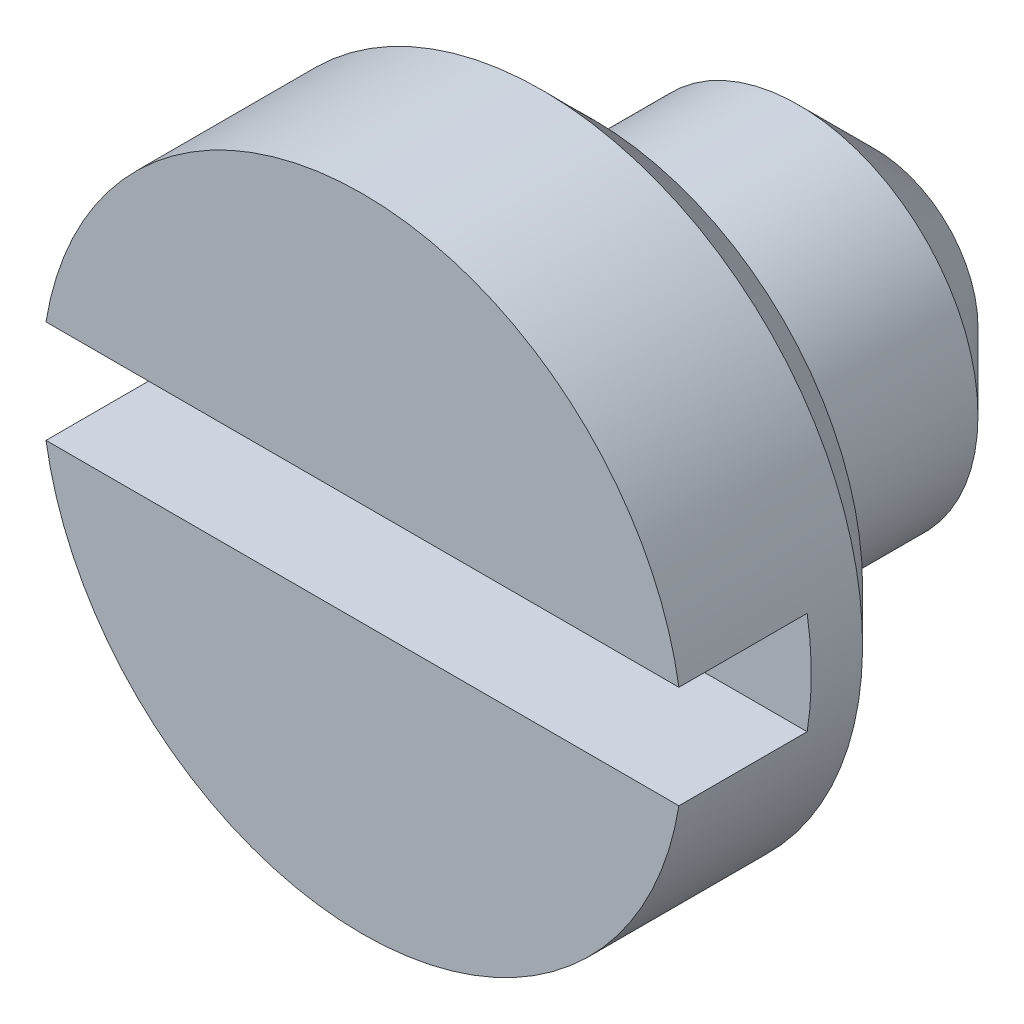
ISO-10303-21;
HEADER;
FILE_DESCRIPTION(('STEP AP214'),'2;1');
FILE_NAME('part.step','',(''),(''),'','','');
FILE_SCHEMA(('AUTOMOTIVE_DESIGN { 1 0 10303 214 1 1 1 1 }'));
ENDSEC;
DATA;
#1=APPLICATION_CONTEXT('core data for automotive mechanical design processes');
#2=APPLICATION_PROTOCOL_DEFINITION('international standard','automotive_design',2000,#1);
#3=PRODUCT_CONTEXT('',#1,'mechanical');
#4=PRODUCT('Part','Part','',(#3));
#5=PRODUCT_RELATED_PRODUCT_CATEGORY('part','',(#4));
#6=PRODUCT_DEFINITION_FORMATION('','',#4);
#7=PRODUCT_DEFINITION_CONTEXT('part definition',#1,'design');
#8=PRODUCT_DEFINITION('design','',#6,#7);
#9=PRODUCT_DEFINITION_SHAPE('','',#8);
#10=(LENGTH_UNIT() NAMED_UNIT(*) SI_UNIT(.MILLI.,.METRE.));
#11=(NAMED_UNIT(*) PLANE_ANGLE_UNIT() SI_UNIT($,.RADIAN.));
#12=(NAMED_UNIT(*) SI_UNIT($,.STERADIAN.) SOLID_ANGLE_UNIT());
#13=UNCERTAINTY_MEASURE_WITH_UNIT(LENGTH_MEASURE(1.E-05),#10,'distance_accuracy_value','');
#14=(GEOMETRIC_REPRESENTATION_CONTEXT(3) GLOBAL_UNCERTAINTY_ASSIGNED_CONTEXT((#13)) GLOBAL_UNIT_ASSIGNED_CONTEXT((#10,
#11,#12)) REPRESENTATION_CONTEXT('',''));
#15=CARTESIAN_POINT('',(0.,0.,0.));
#16=DIRECTION('',(0.,0.,1.));
#17=DIRECTION('',(1.,0.,0.));
#18=AXIS2_PLACEMENT_3D('',#15,#16,#17);
#19=CARTESIAN_POINT('',(0.,0.,0.));
#20=DIRECTION('',(0.,0.,1.));
#21=DIRECTION('',(1.,0.,0.));
#22=AXIS2_PLACEMENT_3D('',#19,#20,#21);
#23=PLANE('',#22);
#24=DIRECTION('',(1.,0.,0.));
#25=VECTOR('',#24,1.);
#26=CARTESIAN_POINT('',(0.,-0.2,0.));
#27=LINE('',#26,#25);
#28=CARTESIAN_POINT('',(-1.23389626792531,-0.2,0.));
#29=VERTEX_POINT('',#28);
#30=CARTESIAN_POINT('',(1.23389626792531,-0.2,0.));
#31=VERTEX_POINT('',#30);
#32=EDGE_CURVE('E85',#29,#31,#27,.T.);
#33=ORIENTED_EDGE('',*,*,#32,.F.);
#34=CARTESIAN_POINT('',(0.,0.,0.));
#35=DIRECTION('',(0.,0.,1.));
#36=DIRECTION('',(1.,0.,0.));
#37=AXIS2_PLACEMENT_3D('',#34,#35,#36);
#38=CIRCLE('',#37,1.25);
#39=EDGE_CURVE('E96',#29,#31,#38,.T.);
#40=ORIENTED_EDGE('',*,*,#39,.T.);
#41=EDGE_LOOP('',(#33,#40));
#42=FACE_BOUND('',#41,.T.);
#43=ADVANCED_FACE('F37',(#42),#23,.T.);
#44=CARTESIAN_POINT('',(0.,0.,-2.));
#45=DIRECTION('',(0.,0.,1.));
#46=DIRECTION('',(1.,0.,0.));
#47=AXIS2_PLACEMENT_3D('',#44,#45,#46);
#48=CYLINDRICAL_SURFACE('',#47,1.25);
#49=CARTESIAN_POINT('',(0.,0.,-0.700000000000001));
#50=DIRECTION('',(0.,0.,-1.));
#51=DIRECTION('',(-1.,0.,0.));
#52=AXIS2_PLACEMENT_3D('',#49,#50,#51);
#53=CIRCLE('',#52,1.25);
#54=CARTESIAN_POINT('',(-1.25,0.,-0.700000000000001));
#55=VERTEX_POINT('',#54);
#56=EDGE_CURVE('E106',#55,#55,#53,.F.);
#57=ORIENTED_EDGE('',*,*,#56,.T.);
#58=EDGE_LOOP('',(#57));
#59=FACE_BOUND('',#58,.T.);
#60=DIRECTION('',(0.,0.,1.));
#61=VECTOR('',#60,1.);
#62=CARTESIAN_POINT('',(1.23389626792531,-0.2,-2.));
#63=LINE('',#62,#61);
#64=CARTESIAN_POINT('',(1.23389626792531,-0.2,-0.5));
#65=VERTEX_POINT('',#64);
#66=EDGE_CURVE('E60',#31,#65,#63,.F.);
#67=ORIENTED_EDGE('',*,*,#66,.F.);
#68=ORIENTED_EDGE('',*,*,#39,.F.);
#69=DIRECTION('',(0.,0.,1.));
#70=VECTOR('',#69,1.);
#71=CARTESIAN_POINT('',(-1.23389626792531,-0.2,-2.));
#72=LINE('',#71,#70);
#73=CARTESIAN_POINT('',(-1.23389626792531,-0.2,-0.5));
#74=VERTEX_POINT('',#73);
#75=EDGE_CURVE('E93',#74,#29,#72,.T.);
#76=ORIENTED_EDGE('',*,*,#75,.F.);
#77=CARTESIAN_POINT('',(0.,0.,-0.5));
#78=DIRECTION('',(0.,0.,-1.));
#79=DIRECTION('',(-1.,0.,0.));
#80=AXIS2_PLACEMENT_3D('',#77,#78,#79);
#81=CIRCLE('',#80,1.25);
#82=CARTESIAN_POINT('',(-1.23389626792531,0.2,-0.5));
#83=VERTEX_POINT('',#82);
#84=EDGE_CURVE('E92',#83,#74,#81,.F.);
#85=ORIENTED_EDGE('',*,*,#84,.F.);
#86=DIRECTION('',(0.,0.,1.));
#87=VECTOR('',#86,1.);
#88=CARTESIAN_POINT('',(-1.23389626792531,0.2,-2.));
#89=LINE('',#88,#87);
#90=CARTESIAN_POINT('',(-1.23389626792531,0.2,0.));
#91=VERTEX_POINT('',#90);
#92=EDGE_CURVE('E80',#91,#83,#89,.F.);
#93=ORIENTED_EDGE('',*,*,#92,.F.);
#94=CARTESIAN_POINT('',(1.23389626792531,0.2,0.));
#95=VERTEX_POINT('',#94);
#96=EDGE_CURVE('E86',#95,#91,#38,.T.);
#97=ORIENTED_EDGE('',*,*,#96,.F.);
#98=DIRECTION('',(0.,0.,1.));
#99=VECTOR('',#98,1.);
#100=CARTESIAN_POINT('',(1.23389626792531,0.2,-2.));
#101=LINE('',#100,#99);
#102=CARTESIAN_POINT('',(1.23389626792531,0.2,-0.5));
#103=VERTEX_POINT('',#102);
#104=EDGE_CURVE('E52',#103,#95,#101,.T.);
#105=ORIENTED_EDGE('',*,*,#104,.F.);
#106=EDGE_CURVE('E105',#65,#103,#81,.F.);
#107=ORIENTED_EDGE('',*,*,#106,.F.);
#108=EDGE_LOOP('',(#67,#68,#76,#85,#93,#97,#105,#107));
#109=FACE_BOUND('',#108,.T.);
#110=ADVANCED_FACE('F90',(#59,#109),#48,.T.);
#111=DIRECTION('',(-1.,0.,0.));
#112=VECTOR('',#111,1.);
#113=CARTESIAN_POINT('',(0.,0.2,0.));
#114=LINE('',#113,#112);
#115=EDGE_CURVE('E77',#95,#91,#114,.T.);
#116=ORIENTED_EDGE('',*,*,#115,.F.);
#117=ORIENTED_EDGE('',*,*,#96,.T.);
#118=EDGE_LOOP('',(#116,#117));
#119=FACE_BOUND('',#118,.T.);
#120=ADVANCED_FACE('F95',(#119),#23,.T.);
#121=CARTESIAN_POINT('',(0.,0.,-0.9));
#122=DIRECTION('',(0.,0.,-1.));
#123=DIRECTION('',(-1.,0.,0.));
#124=AXIS2_PLACEMENT_3D('',#121,#122,#123);
#125=PLANE('',#124);
#126=CARTESIAN_POINT('',(0.,0.,-0.9));
#127=DIRECTION('',(0.,0.,-1.));
#128=DIRECTION('',(-1.,0.,0.));
#129=AXIS2_PLACEMENT_3D('',#126,#127,#128);
#130=CIRCLE('',#129,1.05);
#131=CARTESIAN_POINT('',(-1.05,0.,-0.9));
#132=VERTEX_POINT('',#131);
#133=EDGE_CURVE('E109',#132,#132,#130,.T.);
#134=ORIENTED_EDGE('',*,*,#133,.T.);
#135=EDGE_LOOP('',(#134));
#136=FACE_BOUND('',#135,.T.);
#137=CARTESIAN_POINT('',(0.,0.,-0.9));
#138=DIRECTION('',(0.,0.,-1.));
#139=DIRECTION('',(-1.,0.,0.));
#140=AXIS2_PLACEMENT_3D('',#137,#138,#139);
#141=CIRCLE('',#140,0.7);
#142=CARTESIAN_POINT('',(-0.7,0.,-0.9));
#143=VERTEX_POINT('',#142);
#144=EDGE_CURVE('E99',#143,#143,#141,.T.);
#145=ORIENTED_EDGE('',*,*,#144,.F.);
#146=EDGE_LOOP('',(#145));
#147=FACE_BOUND('',#146,.T.);
#148=ADVANCED_FACE('F136',(#136,#147),#125,.T.);
#149=CARTESIAN_POINT('',(0.,0.,-0.9));
#150=DIRECTION('',(0.,0.,-1.));
#151=DIRECTION('',(-1.,0.,0.));
#152=AXIS2_PLACEMENT_3D('',#149,#150,#151);
#153=CYLINDRICAL_SURFACE('',#152,0.7);
#154=CARTESIAN_POINT('',(0.,0.,-1.7));
#155=DIRECTION('',(0.,0.,1.));
#156=DIRECTION('',(1.,0.,0.));
#157=AXIS2_PLACEMENT_3D('',#154,#155,#156);
#158=CIRCLE('',#157,0.7);
#159=CARTESIAN_POINT('',(0.7,0.,-1.7));
#160=VERTEX_POINT('',#159);
#161=EDGE_CURVE('E12',#160,#160,#158,.T.);
#162=ORIENTED_EDGE('',*,*,#161,.T.);
#163=EDGE_LOOP('',(#162));
#164=FACE_BOUND('',#163,.T.);
#165=ORIENTED_EDGE('',*,*,#144,.T.);
#166=EDGE_LOOP('',(#165));
#167=FACE_BOUND('',#166,.T.);
#168=ADVANCED_FACE('F140',(#164,#167),#153,.T.);
#169=CARTESIAN_POINT('',(0.,0.,-2.));
#170=DIRECTION('',(0.,0.,1.));
#171=DIRECTION('',(1.,0.,0.));
#172=AXIS2_PLACEMENT_3D('',#169,#170,#171);
#173=PLANE('',#172);
#174=CARTESIAN_POINT('',(0.,0.,-2.));
#175=DIRECTION('',(0.,0.,1.));
#176=DIRECTION('',(1.,0.,0.));
#177=AXIS2_PLACEMENT_3D('',#174,#175,#176);
#178=CIRCLE('',#177,0.4);
#179=CARTESIAN_POINT('',(0.4,0.,-2.));
#180=VERTEX_POINT('',#179);
#181=EDGE_CURVE('E45',#180,#180,#178,.F.);
#182=ORIENTED_EDGE('',*,*,#181,.T.);
#183=EDGE_LOOP('',(#182));
#184=FACE_BOUND('',#183,.T.);
#185=ADVANCED_FACE('F114',(#184),#173,.F.);
#186=CARTESIAN_POINT('',(-1.35,-0.2,-0.5));
#187=DIRECTION('',(0.,-1.,0.));
#188=DIRECTION('',(0.,0.,-1.));
#189=AXIS2_PLACEMENT_3D('',#186,#187,#188);
#190=PLANE('',#189);
#191=ORIENTED_EDGE('',*,*,#66,.T.);
#192=DIRECTION('',(1.,0.,0.));
#193=VECTOR('',#192,1.);
#194=CARTESIAN_POINT('',(-1.35,-0.2,-0.5));
#195=LINE('',#194,#193);
#196=EDGE_CURVE('E166',#74,#65,#195,.T.);
#197=ORIENTED_EDGE('',*,*,#196,.F.);
#198=ORIENTED_EDGE('',*,*,#75,.T.);
#199=ORIENTED_EDGE('',*,*,#32,.T.);
#200=EDGE_LOOP('',(#191,#197,#198,#199));
#201=FACE_BOUND('',#200,.T.);
#202=ADVANCED_FACE('F151',(#201),#190,.F.);
#203=CARTESIAN_POINT('',(-1.35,0.2,-0.5));
#204=DIRECTION('',(0.,1.,0.));
#205=DIRECTION('',(0.,0.,1.));
#206=AXIS2_PLACEMENT_3D('',#203,#204,#205);
#207=PLANE('',#206);
#208=ORIENTED_EDGE('',*,*,#92,.T.);
#209=DIRECTION('',(-1.,0.,0.));
#210=VECTOR('',#209,1.);
#211=CARTESIAN_POINT('',(-1.35,0.2,-0.5));
#212=LINE('',#211,#210);
#213=EDGE_CURVE('E165',#103,#83,#212,.T.);
#214=ORIENTED_EDGE('',*,*,#213,.F.);
#215=ORIENTED_EDGE('',*,*,#104,.T.);
#216=ORIENTED_EDGE('',*,*,#115,.T.);
#217=EDGE_LOOP('',(#208,#214,#215,#216));
#218=FACE_BOUND('',#217,.T.);
#219=ADVANCED_FACE('F79',(#218),#207,.F.);
#220=CARTESIAN_POINT('',(0.,0.,-0.5));
#221=DIRECTION('',(0.,0.,-1.));
#222=DIRECTION('',(-1.,0.,0.));
#223=AXIS2_PLACEMENT_3D('',#220,#221,#222);
#224=PLANE('',#223);
#225=ORIENTED_EDGE('',*,*,#106,.T.);
#226=ORIENTED_EDGE('',*,*,#213,.T.);
#227=ORIENTED_EDGE('',*,*,#84,.T.);
#228=ORIENTED_EDGE('',*,*,#196,.T.);
#229=EDGE_LOOP('',(#225,#226,#227,#228));
#230=FACE_BOUND('',#229,.T.);
#231=ADVANCED_FACE('F122',(#230),#224,.F.);
#232=CARTESIAN_POINT('',(0.,0.,-0.700000000000001));
#233=DIRECTION('',(0.,0.,1.));
#234=DIRECTION('',(1.,0.,0.));
#235=AXIS2_PLACEMENT_3D('',#232,#233,#234);
#236=CONICAL_SURFACE('',#235,1.25,0.785398163397449);
#237=ORIENTED_EDGE('',*,*,#133,.F.);
#238=EDGE_LOOP('',(#237));
#239=FACE_BOUND('',#238,.T.);
#240=ORIENTED_EDGE('',*,*,#56,.F.);
#241=EDGE_LOOP('',(#240));
#242=FACE_BOUND('',#241,.T.);
#243=ADVANCED_FACE('F117',(#239,#242),#236,.T.);
#244=CARTESIAN_POINT('',(0.,0.,-2.));
#245=DIRECTION('',(0.,0.,1.));
#246=DIRECTION('',(1.,0.,0.));
#247=AXIS2_PLACEMENT_3D('',#244,#245,#246);
#248=CONICAL_SURFACE('',#247,0.4,0.785398163397446);
#249=ORIENTED_EDGE('',*,*,#161,.F.);
#250=EDGE_LOOP('',(#249));
#251=FACE_BOUND('',#250,.T.);
#252=ORIENTED_EDGE('',*,*,#181,.F.);
#253=EDGE_LOOP('',(#252));
#254=FACE_BOUND('',#253,.T.);
#255=ADVANCED_FACE('F39',(#251,#254),#248,.T.);
#256=CLOSED_SHELL('',(#43,#110,#120,#148,#168,#185,#202,#219,#231,#243,#255));
#257=MANIFOLD_SOLID_BREP('B2',#256);
#258=ADVANCED_BREP_SHAPE_REPRESENTATION('',(#18,#257),#14);
#259=SHAPE_DEFINITION_REPRESENTATION(#9,#258);
ENDSEC;
END-ISO-10303-21;
